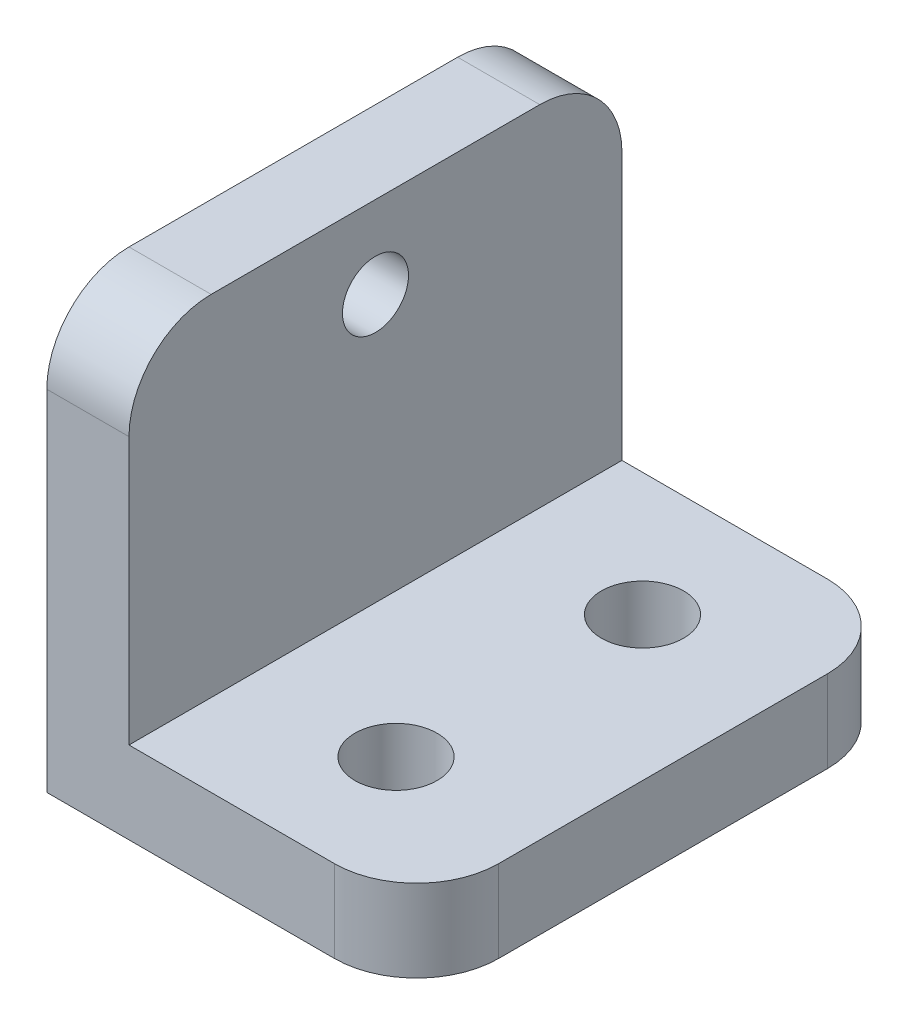
ISO-10303-21;
HEADER;
FILE_DESCRIPTION(('STEP AP214'),'2;1');
FILE_NAME('part.step','',(''),(''),'','','');
FILE_SCHEMA(('AUTOMOTIVE_DESIGN { 1 0 10303 214 1 1 1 1 }'));
ENDSEC;
DATA;
#1=APPLICATION_CONTEXT('core data for automotive mechanical design processes');
#2=APPLICATION_PROTOCOL_DEFINITION('international standard','automotive_design',2000,#1);
#3=PRODUCT_CONTEXT('',#1,'mechanical');
#4=PRODUCT('Part','Part','',(#3));
#5=PRODUCT_RELATED_PRODUCT_CATEGORY('part','',(#4));
#6=PRODUCT_DEFINITION_FORMATION('','',#4);
#7=PRODUCT_DEFINITION_CONTEXT('part definition',#1,'design');
#8=PRODUCT_DEFINITION('design','',#6,#7);
#9=PRODUCT_DEFINITION_SHAPE('','',#8);
#10=(LENGTH_UNIT() NAMED_UNIT(*) SI_UNIT(.MILLI.,.METRE.));
#11=(NAMED_UNIT(*) PLANE_ANGLE_UNIT() SI_UNIT($,.RADIAN.));
#12=(NAMED_UNIT(*) SI_UNIT($,.STERADIAN.) SOLID_ANGLE_UNIT());
#13=UNCERTAINTY_MEASURE_WITH_UNIT(LENGTH_MEASURE(1.E-05),#10,'distance_accuracy_value','');
#14=(GEOMETRIC_REPRESENTATION_CONTEXT(3) GLOBAL_UNCERTAINTY_ASSIGNED_CONTEXT((#13)) GLOBAL_UNIT_ASSIGNED_CONTEXT((#10,
#11,#12)) REPRESENTATION_CONTEXT('',''));
#15=CARTESIAN_POINT('',(0.,0.,0.));
#16=DIRECTION('',(0.,0.,1.));
#17=DIRECTION('',(1.,0.,0.));
#18=AXIS2_PLACEMENT_3D('',#15,#16,#17);
#19=CARTESIAN_POINT('',(0.,6.35,19.05));
#20=DIRECTION('',(0.,0.,-1.));
#21=DIRECTION('',(-1.,0.,0.));
#22=AXIS2_PLACEMENT_3D('',#19,#20,#21);
#23=PLANE('',#22);
#24=DIRECTION('',(0.,-1.,0.));
#25=VECTOR('',#24,1.);
#26=CARTESIAN_POINT('',(-7.93749999999999,33.3375,19.05));
#27=LINE('',#26,#25);
#28=CARTESIAN_POINT('',(-7.93749999999999,26.9875,19.05));
#29=VERTEX_POINT('',#28);
#30=CARTESIAN_POINT('',(-7.93749999999999,6.35,19.05));
#31=VERTEX_POINT('',#30);
#32=EDGE_CURVE('E124',#29,#31,#27,.T.);
#33=ORIENTED_EDGE('',*,*,#32,.F.);
#34=DIRECTION('',(-1.,0.,0.));
#35=VECTOR('',#34,1.);
#36=CARTESIAN_POINT('',(-14.2875,26.9875,19.05));
#37=LINE('',#36,#35);
#38=CARTESIAN_POINT('',(-14.2875,26.9875,19.05));
#39=VERTEX_POINT('',#38);
#40=EDGE_CURVE('E11',#29,#39,#37,.T.);
#41=ORIENTED_EDGE('',*,*,#40,.T.);
#42=DIRECTION('',(0.,-1.,0.));
#43=VECTOR('',#42,1.);
#44=CARTESIAN_POINT('',(-14.2875,6.35,19.05));
#45=LINE('',#44,#43);
#46=CARTESIAN_POINT('',(-14.2875,0.,19.05));
#47=VERTEX_POINT('',#46);
#48=EDGE_CURVE('E136',#39,#47,#45,.T.);
#49=ORIENTED_EDGE('',*,*,#48,.T.);
#50=DIRECTION('',(1.,0.,0.));
#51=VECTOR('',#50,1.);
#52=CARTESIAN_POINT('',(0.,0.,19.05));
#53=LINE('',#52,#51);
#54=CARTESIAN_POINT('',(7.93749999999999,0.,19.05));
#55=VERTEX_POINT('',#54);
#56=EDGE_CURVE('E150',#47,#55,#53,.T.);
#57=ORIENTED_EDGE('',*,*,#56,.T.);
#58=DIRECTION('',(0.,-1.,0.));
#59=VECTOR('',#58,1.);
#60=CARTESIAN_POINT('',(7.93749999999999,6.35,19.05));
#61=LINE('',#60,#59);
#62=CARTESIAN_POINT('',(7.93749999999999,6.35,19.05));
#63=VERTEX_POINT('',#62);
#64=EDGE_CURVE('E183',#55,#63,#61,.F.);
#65=ORIENTED_EDGE('',*,*,#64,.T.);
#66=DIRECTION('',(1.,0.,0.));
#67=VECTOR('',#66,1.);
#68=CARTESIAN_POINT('',(0.,6.35,19.05));
#69=LINE('',#68,#67);
#70=EDGE_CURVE('E152',#31,#63,#69,.T.);
#71=ORIENTED_EDGE('',*,*,#70,.F.);
#72=EDGE_LOOP('',(#33,#41,#49,#57,#65,#71));
#73=FACE_BOUND('',#72,.T.);
#74=ADVANCED_FACE('F39',(#73),#23,.F.);
#75=CARTESIAN_POINT('',(14.2875,6.35,0.));
#76=DIRECTION('',(-1.,0.,0.));
#77=DIRECTION('',(0.,0.,1.));
#78=AXIS2_PLACEMENT_3D('',#75,#76,#77);
#79=PLANE('',#78);
#80=DIRECTION('',(0.,0.,-1.));
#81=VECTOR('',#80,1.);
#82=CARTESIAN_POINT('',(14.2875,0.,0.));
#83=LINE('',#82,#81);
#84=CARTESIAN_POINT('',(14.2875,0.,12.7));
#85=VERTEX_POINT('',#84);
#86=CARTESIAN_POINT('',(14.2875,0.,-12.7));
#87=VERTEX_POINT('',#86);
#88=EDGE_CURVE('E158',#85,#87,#83,.T.);
#89=ORIENTED_EDGE('',*,*,#88,.T.);
#90=DIRECTION('',(0.,-1.,0.));
#91=VECTOR('',#90,1.);
#92=CARTESIAN_POINT('',(14.2875,6.35,-12.7));
#93=LINE('',#92,#91);
#94=CARTESIAN_POINT('',(14.2875,6.35,-12.7));
#95=VERTEX_POINT('',#94);
#96=EDGE_CURVE('E178',#87,#95,#93,.F.);
#97=ORIENTED_EDGE('',*,*,#96,.T.);
#98=DIRECTION('',(0.,0.,-1.));
#99=VECTOR('',#98,1.);
#100=CARTESIAN_POINT('',(14.2875,6.35,0.));
#101=LINE('',#100,#99);
#102=CARTESIAN_POINT('',(14.2875,6.35,12.7));
#103=VERTEX_POINT('',#102);
#104=EDGE_CURVE('E137',#103,#95,#101,.T.);
#105=ORIENTED_EDGE('',*,*,#104,.F.);
#106=DIRECTION('',(0.,-1.,0.));
#107=VECTOR('',#106,1.);
#108=CARTESIAN_POINT('',(14.2875,6.35,12.7));
#109=LINE('',#108,#107);
#110=EDGE_CURVE('E175',#103,#85,#109,.T.);
#111=ORIENTED_EDGE('',*,*,#110,.T.);
#112=EDGE_LOOP('',(#89,#97,#105,#111));
#113=FACE_BOUND('',#112,.T.);
#114=ADVANCED_FACE('F221',(#113),#79,.F.);
#115=CARTESIAN_POINT('',(0.,6.35,-19.05));
#116=DIRECTION('',(0.,0.,-1.));
#117=DIRECTION('',(-1.,0.,0.));
#118=AXIS2_PLACEMENT_3D('',#115,#116,#117);
#119=PLANE('',#118);
#120=DIRECTION('',(0.,-1.,0.));
#121=VECTOR('',#120,1.);
#122=CARTESIAN_POINT('',(-14.2875,6.35,-19.05));
#123=LINE('',#122,#121);
#124=CARTESIAN_POINT('',(-14.2875,26.9875,-19.05));
#125=VERTEX_POINT('',#124);
#126=CARTESIAN_POINT('',(-14.2875,0.,-19.05));
#127=VERTEX_POINT('',#126);
#128=EDGE_CURVE('E167',#125,#127,#123,.T.);
#129=ORIENTED_EDGE('',*,*,#128,.F.);
#130=DIRECTION('',(-1.,0.,0.));
#131=VECTOR('',#130,1.);
#132=CARTESIAN_POINT('',(0.,26.9875,-19.05));
#133=LINE('',#132,#131);
#134=CARTESIAN_POINT('',(-7.93749999999999,26.9875,-19.05));
#135=VERTEX_POINT('',#134);
#136=EDGE_CURVE('E62',#125,#135,#133,.F.);
#137=ORIENTED_EDGE('',*,*,#136,.T.);
#138=DIRECTION('',(0.,-1.,0.));
#139=VECTOR('',#138,1.);
#140=CARTESIAN_POINT('',(-7.93749999999999,33.3375,-19.05));
#141=LINE('',#140,#139);
#142=CARTESIAN_POINT('',(-7.93749999999999,6.35,-19.05));
#143=VERTEX_POINT('',#142);
#144=EDGE_CURVE('E116',#135,#143,#141,.T.);
#145=ORIENTED_EDGE('',*,*,#144,.T.);
#146=DIRECTION('',(1.,0.,0.));
#147=VECTOR('',#146,1.);
#148=CARTESIAN_POINT('',(0.,6.35,-19.05));
#149=LINE('',#148,#147);
#150=CARTESIAN_POINT('',(7.9375,6.35,-19.05));
#151=VERTEX_POINT('',#150);
#152=EDGE_CURVE('E120',#143,#151,#149,.T.);
#153=ORIENTED_EDGE('',*,*,#152,.T.);
#154=DIRECTION('',(0.,-1.,0.));
#155=VECTOR('',#154,1.);
#156=CARTESIAN_POINT('',(7.9375,0.,-19.05));
#157=LINE('',#156,#155);
#158=CARTESIAN_POINT('',(7.9375,0.,-19.05));
#159=VERTEX_POINT('',#158);
#160=EDGE_CURVE('E169',#151,#159,#157,.T.);
#161=ORIENTED_EDGE('',*,*,#160,.T.);
#162=DIRECTION('',(1.,0.,0.));
#163=VECTOR('',#162,1.);
#164=CARTESIAN_POINT('',(0.,0.,-19.05));
#165=LINE('',#164,#163);
#166=EDGE_CURVE('E161',#127,#159,#165,.T.);
#167=ORIENTED_EDGE('',*,*,#166,.F.);
#168=EDGE_LOOP('',(#129,#137,#145,#153,#161,#167));
#169=FACE_BOUND('',#168,.T.);
#170=ADVANCED_FACE('F118',(#169),#119,.T.);
#171=CARTESIAN_POINT('',(-14.2875,6.35,0.));
#172=DIRECTION('',(-1.,0.,0.));
#173=DIRECTION('',(0.,0.,1.));
#174=AXIS2_PLACEMENT_3D('',#171,#172,#173);
#175=PLANE('',#174);
#176=CARTESIAN_POINT('',(-14.2875,26.9875,0.));
#177=DIRECTION('',(-1.,0.,0.));
#178=DIRECTION('',(0.,0.,1.));
#179=AXIS2_PLACEMENT_3D('',#176,#177,#178);
#180=CIRCLE('',#179,2.5527);
#181=CARTESIAN_POINT('',(-14.2875,26.9875,2.5527));
#182=VERTEX_POINT('',#181);
#183=EDGE_CURVE('E392',#182,#182,#180,.T.);
#184=ORIENTED_EDGE('',*,*,#183,.F.);
#185=EDGE_LOOP('',(#184));
#186=FACE_BOUND('',#185,.T.);
#187=DIRECTION('',(0.,0.,1.));
#188=VECTOR('',#187,1.);
#189=CARTESIAN_POINT('',(-14.2875,33.3375,0.));
#190=LINE('',#189,#188);
#191=CARTESIAN_POINT('',(-14.2875,33.3375,-12.7));
#192=VERTEX_POINT('',#191);
#193=CARTESIAN_POINT('',(-14.2875,33.3375,12.7));
#194=VERTEX_POINT('',#193);
#195=EDGE_CURVE('E140',#192,#194,#190,.T.);
#196=ORIENTED_EDGE('',*,*,#195,.F.);
#197=CARTESIAN_POINT('',(-14.2875,26.9875,-12.7));
#198=DIRECTION('',(-1.,0.,0.));
#199=DIRECTION('',(0.,0.,1.));
#200=AXIS2_PLACEMENT_3D('',#197,#198,#199);
#201=CIRCLE('',#200,6.35);
#202=EDGE_CURVE('E192',#192,#125,#201,.T.);
#203=ORIENTED_EDGE('',*,*,#202,.T.);
#204=ORIENTED_EDGE('',*,*,#128,.T.);
#205=DIRECTION('',(0.,0.,-1.));
#206=VECTOR('',#205,1.);
#207=CARTESIAN_POINT('',(-14.2875,0.,0.));
#208=LINE('',#207,#206);
#209=EDGE_CURVE('E154',#47,#127,#208,.T.);
#210=ORIENTED_EDGE('',*,*,#209,.F.);
#211=ORIENTED_EDGE('',*,*,#48,.F.);
#212=CARTESIAN_POINT('',(-14.2875,26.9875,12.7));
#213=DIRECTION('',(-1.,0.,0.));
#214=DIRECTION('',(0.,0.,1.));
#215=AXIS2_PLACEMENT_3D('',#212,#213,#214);
#216=CIRCLE('',#215,6.35);
#217=EDGE_CURVE('E190',#39,#194,#216,.T.);
#218=ORIENTED_EDGE('',*,*,#217,.T.);
#219=EDGE_LOOP('',(#196,#203,#204,#210,#211,#218));
#220=FACE_BOUND('',#219,.T.);
#221=ADVANCED_FACE('F204',(#186,#220),#175,.T.);
#222=CARTESIAN_POINT('',(0.,6.35,0.));
#223=DIRECTION('',(0.,1.,0.));
#224=DIRECTION('',(0.,0.,1.));
#225=AXIS2_PLACEMENT_3D('',#222,#223,#224);
#226=PLANE('',#225);
#227=CARTESIAN_POINT('',(3.17499999999999,6.35,9.525));
#228=DIRECTION('',(0.,1.,0.));
#229=DIRECTION('',(0.,0.,1.));
#230=AXIS2_PLACEMENT_3D('',#227,#228,#229);
#231=CIRCLE('',#230,3.175);
#232=CARTESIAN_POINT('',(3.17499999999999,6.35,12.7));
#233=VERTEX_POINT('',#232);
#234=EDGE_CURVE('E383',#233,#233,#231,.T.);
#235=ORIENTED_EDGE('',*,*,#234,.F.);
#236=EDGE_LOOP('',(#235));
#237=FACE_BOUND('',#236,.T.);
#238=CARTESIAN_POINT('',(3.175,6.35,-9.525));
#239=DIRECTION('',(0.,1.,0.));
#240=DIRECTION('',(0.,0.,1.));
#241=AXIS2_PLACEMENT_3D('',#238,#239,#240);
#242=CIRCLE('',#241,3.175);
#243=CARTESIAN_POINT('',(3.175,6.35,-6.35));
#244=VERTEX_POINT('',#243);
#245=EDGE_CURVE('E146',#244,#244,#242,.T.);
#246=ORIENTED_EDGE('',*,*,#245,.F.);
#247=EDGE_LOOP('',(#246));
#248=FACE_BOUND('',#247,.T.);
#249=ORIENTED_EDGE('',*,*,#104,.T.);
#250=CARTESIAN_POINT('',(7.9375,6.35,-12.7));
#251=DIRECTION('',(0.,1.,0.));
#252=DIRECTION('',(0.,0.,1.));
#253=AXIS2_PLACEMENT_3D('',#250,#251,#252);
#254=CIRCLE('',#253,6.35);
#255=EDGE_CURVE('E135',#95,#151,#254,.T.);
#256=ORIENTED_EDGE('',*,*,#255,.T.);
#257=ORIENTED_EDGE('',*,*,#152,.F.);
#258=DIRECTION('',(0.,0.,-1.));
#259=VECTOR('',#258,1.);
#260=CARTESIAN_POINT('',(-7.93749999999999,6.35,0.));
#261=LINE('',#260,#259);
#262=EDGE_CURVE('E132',#31,#143,#261,.T.);
#263=ORIENTED_EDGE('',*,*,#262,.F.);
#264=ORIENTED_EDGE('',*,*,#70,.T.);
#265=CARTESIAN_POINT('',(7.93749999999999,6.35,12.7));
#266=DIRECTION('',(0.,1.,0.));
#267=DIRECTION('',(0.,0.,1.));
#268=AXIS2_PLACEMENT_3D('',#265,#266,#267);
#269=CIRCLE('',#268,6.35);
#270=EDGE_CURVE('E180',#63,#103,#269,.T.);
#271=ORIENTED_EDGE('',*,*,#270,.T.);
#272=EDGE_LOOP('',(#249,#256,#257,#263,#264,#271));
#273=FACE_BOUND('',#272,.T.);
#274=ADVANCED_FACE('F130',(#237,#248,#273),#226,.T.);
#275=CARTESIAN_POINT('',(0.,0.,0.));
#276=DIRECTION('',(0.,1.,0.));
#277=DIRECTION('',(0.,0.,1.));
#278=AXIS2_PLACEMENT_3D('',#275,#276,#277);
#279=PLANE('',#278);
#280=CARTESIAN_POINT('',(3.17499999999999,0.,9.525));
#281=DIRECTION('',(0.,1.,0.));
#282=DIRECTION('',(0.,0.,1.));
#283=AXIS2_PLACEMENT_3D('',#280,#281,#282);
#284=CIRCLE('',#283,3.175);
#285=CARTESIAN_POINT('',(3.17499999999999,0.,12.7));
#286=VERTEX_POINT('',#285);
#287=EDGE_CURVE('E386',#286,#286,#284,.T.);
#288=ORIENTED_EDGE('',*,*,#287,.T.);
#289=EDGE_LOOP('',(#288));
#290=FACE_BOUND('',#289,.T.);
#291=CARTESIAN_POINT('',(3.175,0.,-9.525));
#292=DIRECTION('',(0.,1.,0.));
#293=DIRECTION('',(0.,0.,1.));
#294=AXIS2_PLACEMENT_3D('',#291,#292,#293);
#295=CIRCLE('',#294,3.175);
#296=CARTESIAN_POINT('',(3.175,0.,-6.35000000000001));
#297=VERTEX_POINT('',#296);
#298=EDGE_CURVE('E141',#297,#297,#295,.T.);
#299=ORIENTED_EDGE('',*,*,#298,.T.);
#300=EDGE_LOOP('',(#299));
#301=FACE_BOUND('',#300,.T.);
#302=ORIENTED_EDGE('',*,*,#166,.T.);
#303=CARTESIAN_POINT('',(7.9375,0.,-12.7));
#304=DIRECTION('',(0.,1.,0.));
#305=DIRECTION('',(0.,0.,1.));
#306=AXIS2_PLACEMENT_3D('',#303,#304,#305);
#307=CIRCLE('',#306,6.35);
#308=EDGE_CURVE('E173',#159,#87,#307,.F.);
#309=ORIENTED_EDGE('',*,*,#308,.T.);
#310=ORIENTED_EDGE('',*,*,#88,.F.);
#311=CARTESIAN_POINT('',(7.93749999999999,0.,12.7));
#312=DIRECTION('',(0.,1.,0.));
#313=DIRECTION('',(0.,0.,1.));
#314=AXIS2_PLACEMENT_3D('',#311,#312,#313);
#315=CIRCLE('',#314,6.35);
#316=EDGE_CURVE('E171',#85,#55,#315,.F.);
#317=ORIENTED_EDGE('',*,*,#316,.T.);
#318=ORIENTED_EDGE('',*,*,#56,.F.);
#319=ORIENTED_EDGE('',*,*,#209,.T.);
#320=EDGE_LOOP('',(#302,#309,#310,#317,#318,#319));
#321=FACE_BOUND('',#320,.T.);
#322=ADVANCED_FACE('F209',(#290,#301,#321),#279,.F.);
#323=CARTESIAN_POINT('',(-7.93749999999999,33.3375,0.));
#324=DIRECTION('',(-1.,0.,0.));
#325=DIRECTION('',(0.,0.,1.));
#326=AXIS2_PLACEMENT_3D('',#323,#324,#325);
#327=PLANE('',#326);
#328=CARTESIAN_POINT('',(-7.93749999999999,26.9875,0.));
#329=DIRECTION('',(1.,0.,0.));
#330=DIRECTION('',(0.,0.,-1.));
#331=AXIS2_PLACEMENT_3D('',#328,#329,#330);
#332=CIRCLE('',#331,2.5527);
#333=CARTESIAN_POINT('',(-7.93749999999999,26.9875,-2.5527));
#334=VERTEX_POINT('',#333);
#335=EDGE_CURVE('E395',#334,#334,#332,.T.);
#336=ORIENTED_EDGE('',*,*,#335,.F.);
#337=EDGE_LOOP('',(#336));
#338=FACE_BOUND('',#337,.T.);
#339=ORIENTED_EDGE('',*,*,#144,.F.);
#340=CARTESIAN_POINT('',(-7.93749999999999,26.9875,-12.7));
#341=DIRECTION('',(-1.,0.,0.));
#342=DIRECTION('',(0.,0.,1.));
#343=AXIS2_PLACEMENT_3D('',#340,#341,#342);
#344=CIRCLE('',#343,6.35);
#345=CARTESIAN_POINT('',(-7.93749999999999,33.3375,-12.7));
#346=VERTEX_POINT('',#345);
#347=EDGE_CURVE('E47',#135,#346,#344,.F.);
#348=ORIENTED_EDGE('',*,*,#347,.T.);
#349=DIRECTION('',(0.,0.,-1.));
#350=VECTOR('',#349,1.);
#351=CARTESIAN_POINT('',(-7.93749999999999,33.3375,0.));
#352=LINE('',#351,#350);
#353=CARTESIAN_POINT('',(-7.93749999999999,33.3375,12.7));
#354=VERTEX_POINT('',#353);
#355=EDGE_CURVE('E125',#354,#346,#352,.T.);
#356=ORIENTED_EDGE('',*,*,#355,.F.);
#357=CARTESIAN_POINT('',(-7.93749999999999,26.9875,12.7));
#358=DIRECTION('',(-1.,0.,0.));
#359=DIRECTION('',(0.,0.,1.));
#360=AXIS2_PLACEMENT_3D('',#357,#358,#359);
#361=CIRCLE('',#360,6.35);
#362=EDGE_CURVE('E54',#354,#29,#361,.F.);
#363=ORIENTED_EDGE('',*,*,#362,.T.);
#364=ORIENTED_EDGE('',*,*,#32,.T.);
#365=ORIENTED_EDGE('',*,*,#262,.T.);
#366=EDGE_LOOP('',(#339,#348,#356,#363,#364,#365));
#367=FACE_BOUND('',#366,.T.);
#368=ADVANCED_FACE('F139',(#338,#367),#327,.F.);
#369=CARTESIAN_POINT('',(0.,33.3375,0.));
#370=DIRECTION('',(0.,1.,0.));
#371=DIRECTION('',(0.,0.,1.));
#372=AXIS2_PLACEMENT_3D('',#369,#370,#371);
#373=PLANE('',#372);
#374=ORIENTED_EDGE('',*,*,#355,.T.);
#375=DIRECTION('',(-1.,0.,0.));
#376=VECTOR('',#375,1.);
#377=CARTESIAN_POINT('',(0.,33.3375,-12.7));
#378=LINE('',#377,#376);
#379=EDGE_CURVE('E187',#346,#192,#378,.T.);
#380=ORIENTED_EDGE('',*,*,#379,.T.);
#381=ORIENTED_EDGE('',*,*,#195,.T.);
#382=DIRECTION('',(-1.,0.,0.));
#383=VECTOR('',#382,1.);
#384=CARTESIAN_POINT('',(-7.93749999999999,33.3375,12.7));
#385=LINE('',#384,#383);
#386=EDGE_CURVE('E185',#194,#354,#385,.F.);
#387=ORIENTED_EDGE('',*,*,#386,.T.);
#388=EDGE_LOOP('',(#374,#380,#381,#387));
#389=FACE_BOUND('',#388,.T.);
#390=ADVANCED_FACE('F199',(#389),#373,.T.);
#391=CARTESIAN_POINT('',(3.175,6.35,-9.525));
#392=DIRECTION('',(0.,1.,0.));
#393=DIRECTION('',(0.,0.,1.));
#394=AXIS2_PLACEMENT_3D('',#391,#392,#393);
#395=CYLINDRICAL_SURFACE('',#394,3.175);
#396=ORIENTED_EDGE('',*,*,#298,.F.);
#397=EDGE_LOOP('',(#396));
#398=FACE_BOUND('',#397,.T.);
#399=ORIENTED_EDGE('',*,*,#245,.T.);
#400=EDGE_LOOP('',(#399));
#401=FACE_BOUND('',#400,.T.);
#402=ADVANCED_FACE('F264',(#398,#401),#395,.F.);
#403=CARTESIAN_POINT('',(3.17499999999999,6.35,9.525));
#404=DIRECTION('',(0.,1.,0.));
#405=DIRECTION('',(0.,0.,1.));
#406=AXIS2_PLACEMENT_3D('',#403,#404,#405);
#407=CYLINDRICAL_SURFACE('',#406,3.175);
#408=ORIENTED_EDGE('',*,*,#287,.F.);
#409=EDGE_LOOP('',(#408));
#410=FACE_BOUND('',#409,.T.);
#411=ORIENTED_EDGE('',*,*,#234,.T.);
#412=EDGE_LOOP('',(#411));
#413=FACE_BOUND('',#412,.T.);
#414=ADVANCED_FACE('F335',(#410,#413),#407,.F.);
#415=CARTESIAN_POINT('',(-7.93749999999999,26.9875,0.));
#416=DIRECTION('',(1.,0.,0.));
#417=DIRECTION('',(0.,0.,-1.));
#418=AXIS2_PLACEMENT_3D('',#415,#416,#417);
#419=CYLINDRICAL_SURFACE('',#418,2.5527);
#420=ORIENTED_EDGE('',*,*,#183,.T.);
#421=EDGE_LOOP('',(#420));
#422=FACE_BOUND('',#421,.T.);
#423=ORIENTED_EDGE('',*,*,#335,.T.);
#424=EDGE_LOOP('',(#423));
#425=FACE_BOUND('',#424,.T.);
#426=ADVANCED_FACE('F233',(#422,#425),#419,.F.);
#427=CARTESIAN_POINT('',(7.9375,6.35,-12.7));
#428=DIRECTION('',(0.,1.,0.));
#429=DIRECTION('',(0.,0.,1.));
#430=AXIS2_PLACEMENT_3D('',#427,#428,#429);
#431=CYLINDRICAL_SURFACE('',#430,6.35);
#432=ORIENTED_EDGE('',*,*,#255,.F.);
#433=ORIENTED_EDGE('',*,*,#96,.F.);
#434=ORIENTED_EDGE('',*,*,#308,.F.);
#435=ORIENTED_EDGE('',*,*,#160,.F.);
#436=EDGE_LOOP('',(#432,#433,#434,#435));
#437=FACE_BOUND('',#436,.T.);
#438=ADVANCED_FACE('F230',(#437),#431,.T.);
#439=CARTESIAN_POINT('',(7.93749999999999,6.35,12.7));
#440=DIRECTION('',(0.,-1.,0.));
#441=DIRECTION('',(0.,0.,-1.));
#442=AXIS2_PLACEMENT_3D('',#439,#440,#441);
#443=CYLINDRICAL_SURFACE('',#442,6.35);
#444=ORIENTED_EDGE('',*,*,#270,.F.);
#445=ORIENTED_EDGE('',*,*,#64,.F.);
#446=ORIENTED_EDGE('',*,*,#316,.F.);
#447=ORIENTED_EDGE('',*,*,#110,.F.);
#448=EDGE_LOOP('',(#444,#445,#446,#447));
#449=FACE_BOUND('',#448,.T.);
#450=ADVANCED_FACE('F219',(#449),#443,.T.);
#451=CARTESIAN_POINT('',(0.,26.9875,-12.7));
#452=DIRECTION('',(-1.,0.,0.));
#453=DIRECTION('',(0.,0.,1.));
#454=AXIS2_PLACEMENT_3D('',#451,#452,#453);
#455=CYLINDRICAL_SURFACE('',#454,6.35);
#456=ORIENTED_EDGE('',*,*,#347,.F.);
#457=ORIENTED_EDGE('',*,*,#136,.F.);
#458=ORIENTED_EDGE('',*,*,#202,.F.);
#459=ORIENTED_EDGE('',*,*,#379,.F.);
#460=EDGE_LOOP('',(#456,#457,#458,#459));
#461=FACE_BOUND('',#460,.T.);
#462=ADVANCED_FACE('F202',(#461),#455,.T.);
#463=CARTESIAN_POINT('',(0.,26.9875,12.7));
#464=DIRECTION('',(1.,0.,0.));
#465=DIRECTION('',(0.,0.,-1.));
#466=AXIS2_PLACEMENT_3D('',#463,#464,#465);
#467=CYLINDRICAL_SURFACE('',#466,6.35);
#468=ORIENTED_EDGE('',*,*,#362,.F.);
#469=ORIENTED_EDGE('',*,*,#386,.F.);
#470=ORIENTED_EDGE('',*,*,#217,.F.);
#471=ORIENTED_EDGE('',*,*,#40,.F.);
#472=EDGE_LOOP('',(#468,#469,#470,#471));
#473=FACE_BOUND('',#472,.T.);
#474=ADVANCED_FACE('F41',(#473),#467,.T.);
#475=CLOSED_SHELL('',(#74,#114,#170,#221,#274,#322,#368,#390,#402,#414,#426,#438,#450,#462,#474));
#476=MANIFOLD_SOLID_BREP('B2',#475);
#477=ADVANCED_BREP_SHAPE_REPRESENTATION('',(#18,#476),#14);
#478=SHAPE_DEFINITION_REPRESENTATION(#9,#477);
ENDSEC;
END-ISO-10303-21;
